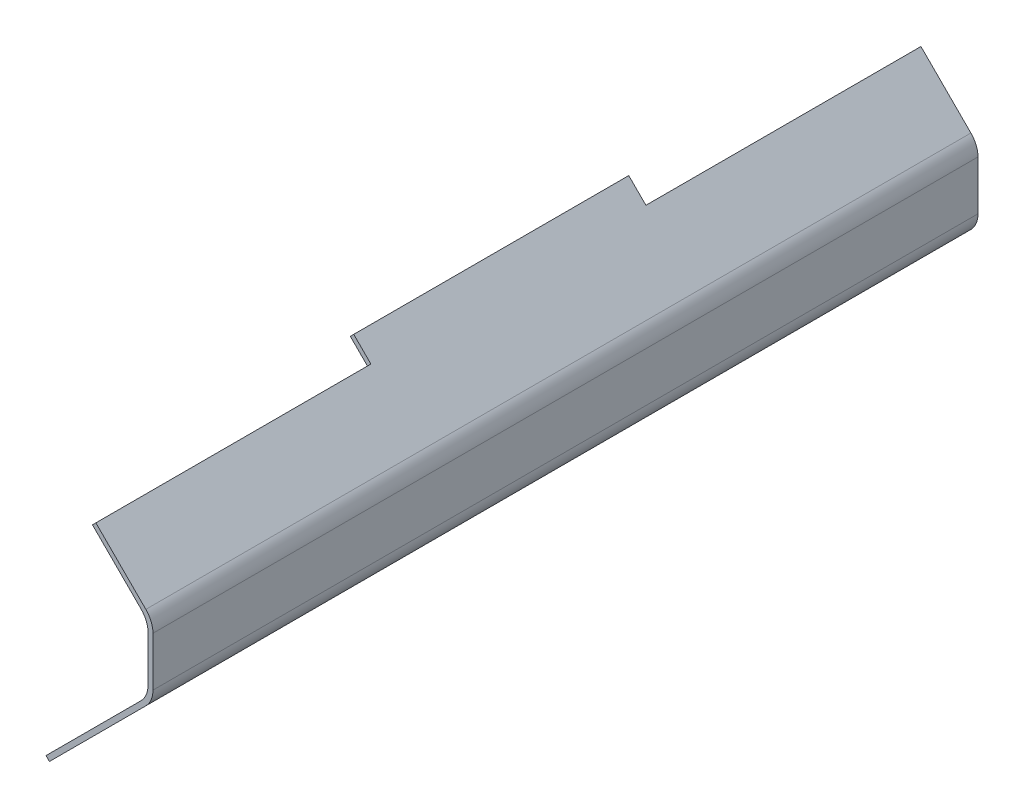
ISO-10303-21;
HEADER;
FILE_DESCRIPTION(('STEP AP214'),'2;1');
FILE_NAME('part.step','',(''),(''),'','','');
FILE_SCHEMA(('AUTOMOTIVE_DESIGN { 1 0 10303 214 1 1 1 1 }'));
ENDSEC;
DATA;
#1=APPLICATION_CONTEXT('core data for automotive mechanical design processes');
#2=APPLICATION_PROTOCOL_DEFINITION('international standard','automotive_design',2000,#1);
#3=PRODUCT_CONTEXT('',#1,'mechanical');
#4=PRODUCT('Part','Part','',(#3));
#5=PRODUCT_RELATED_PRODUCT_CATEGORY('part','',(#4));
#6=PRODUCT_DEFINITION_FORMATION('','',#4);
#7=PRODUCT_DEFINITION_CONTEXT('part definition',#1,'design');
#8=PRODUCT_DEFINITION('design','',#6,#7);
#9=PRODUCT_DEFINITION_SHAPE('','',#8);
#10=(LENGTH_UNIT() NAMED_UNIT(*) SI_UNIT(.MILLI.,.METRE.));
#11=(NAMED_UNIT(*) PLANE_ANGLE_UNIT() SI_UNIT($,.RADIAN.));
#12=(NAMED_UNIT(*) SI_UNIT($,.STERADIAN.) SOLID_ANGLE_UNIT());
#13=UNCERTAINTY_MEASURE_WITH_UNIT(LENGTH_MEASURE(1.E-05),#10,'distance_accuracy_value','');
#14=(GEOMETRIC_REPRESENTATION_CONTEXT(3) GLOBAL_UNCERTAINTY_ASSIGNED_CONTEXT((#13)) GLOBAL_UNIT_ASSIGNED_CONTEXT((#10,
#11,#12)) REPRESENTATION_CONTEXT('',''));
#15=CARTESIAN_POINT('',(0.,0.,0.));
#16=DIRECTION('',(0.,0.,1.));
#17=DIRECTION('',(1.,0.,0.));
#18=AXIS2_PLACEMENT_3D('',#15,#16,#17);
#19=CARTESIAN_POINT('',(37.8050865276332,-56.9472221513642,340.));
#20=DIRECTION('',(0.707106781186551,0.707106781186544,0.));
#21=DIRECTION('',(-0.707106781186544,0.707106781186551,0.));
#22=AXIS2_PLACEMENT_3D('',#19,#20,#21);
#23=PLANE('',#22);
#24=DIRECTION('',(0.,0.,-1.));
#25=VECTOR('',#24,1.);
#26=CARTESIAN_POINT('',(37.8050865276332,-56.9472221513642,340.));
#27=LINE('',#26,#25);
#28=CARTESIAN_POINT('',(37.8050865276332,-56.9472221513642,113.333333333333));
#29=VERTEX_POINT('',#28);
#30=CARTESIAN_POINT('',(37.8050865276332,-56.9472221513642,0.));
#31=VERTEX_POINT('',#30);
#32=EDGE_CURVE('E189',#29,#31,#27,.T.);
#33=ORIENTED_EDGE('',*,*,#32,.F.);
#34=DIRECTION('',(-0.707106781186548,0.707106781186547,0.));
#35=VECTOR('',#34,1.);
#36=CARTESIAN_POINT('',(59.1335136523794,-78.2756492761103,113.333333333333));
#37=LINE('',#36,#35);
#38=CARTESIAN_POINT('',(36.3908729652601,-55.5330085889911,113.333333333333));
#39=VERTEX_POINT('',#38);
#40=EDGE_CURVE('E173',#29,#39,#37,.T.);
#41=ORIENTED_EDGE('',*,*,#40,.T.);
#42=DIRECTION('',(0.,0.,-1.));
#43=VECTOR('',#42,1.);
#44=CARTESIAN_POINT('',(36.3908729652601,-55.5330085889911,340.));
#45=LINE('',#44,#43);
#46=CARTESIAN_POINT('',(36.3908729652601,-55.5330085889911,0.));
#47=VERTEX_POINT('',#46);
#48=EDGE_CURVE('E187',#39,#47,#45,.T.);
#49=ORIENTED_EDGE('',*,*,#48,.T.);
#50=DIRECTION('',(0.707106781186544,-0.707106781186551,0.));
#51=VECTOR('',#50,1.);
#52=CARTESIAN_POINT('',(37.8050865276332,-56.9472221513642,0.));
#53=LINE('',#52,#51);
#54=EDGE_CURVE('E296',#47,#31,#53,.T.);
#55=ORIENTED_EDGE('',*,*,#54,.T.);
#56=EDGE_LOOP('',(#33,#41,#49,#55));
#57=FACE_BOUND('',#56,.T.);
#58=ADVANCED_FACE('F32',(#57),#23,.F.);
#59=CARTESIAN_POINT('',(78.4619407771256,13.4619407771256,340.));
#60=DIRECTION('',(0.707106781186547,0.707106781186547,0.));
#61=DIRECTION('',(-0.707106781186548,0.707106781186548,0.));
#62=AXIS2_PLACEMENT_3D('',#59,#60,#61);
#63=PLANE('',#62);
#64=DIRECTION('',(0.707106781186547,-0.707106781186547,0.));
#65=VECTOR('',#64,1.);
#66=CARTESIAN_POINT('',(78.4619407771256,13.4619407771256,0.));
#67=LINE('',#66,#65);
#68=CARTESIAN_POINT('',(55.533008588991,36.3908729652601,0.));
#69=VERTEX_POINT('',#68);
#70=CARTESIAN_POINT('',(75.5330085889911,16.3908729652601,0.));
#71=VERTEX_POINT('',#70);
#72=EDGE_CURVE('E253',#69,#71,#67,.T.);
#73=ORIENTED_EDGE('',*,*,#72,.T.);
#74=DIRECTION('',(0.,0.,-1.));
#75=VECTOR('',#74,1.);
#76=CARTESIAN_POINT('',(75.5330085889911,16.3908729652601,340.));
#77=LINE('',#76,#75);
#78=CARTESIAN_POINT('',(75.5330085889911,16.3908729652601,340.));
#79=VERTEX_POINT('',#78);
#80=EDGE_CURVE('E242',#71,#79,#77,.F.);
#81=ORIENTED_EDGE('',*,*,#80,.T.);
#82=DIRECTION('',(0.707106781186547,-0.707106781186547,0.));
#83=VECTOR('',#82,1.);
#84=CARTESIAN_POINT('',(78.4619407771256,13.4619407771256,340.));
#85=LINE('',#84,#83);
#86=CARTESIAN_POINT('',(55.533008588991,36.3908729652601,340.));
#87=VERTEX_POINT('',#86);
#88=EDGE_CURVE('E274',#87,#79,#85,.T.);
#89=ORIENTED_EDGE('',*,*,#88,.F.);
#90=DIRECTION('',(0.,0.,1.));
#91=VECTOR('',#90,1.);
#92=CARTESIAN_POINT('',(55.533008588991,36.3908729652601,340.));
#93=LINE('',#92,#91);
#94=CARTESIAN_POINT('',(55.533008588991,36.3908729652601,226.666666666667));
#95=VERTEX_POINT('',#94);
#96=EDGE_CURVE('E354',#95,#87,#93,.T.);
#97=ORIENTED_EDGE('',*,*,#96,.F.);
#98=DIRECTION('',(0.707106781186547,-0.707106781186547,0.));
#99=VECTOR('',#98,1.);
#100=CARTESIAN_POINT('',(48.4619407771256,43.4619407771256,226.666666666667));
#101=LINE('',#100,#99);
#102=CARTESIAN_POINT('',(48.4619407771256,43.4619407771256,226.666666666667));
#103=VERTEX_POINT('',#102);
#104=EDGE_CURVE('E357',#103,#95,#101,.T.);
#105=ORIENTED_EDGE('',*,*,#104,.F.);
#106=DIRECTION('',(0.,0.,-1.));
#107=VECTOR('',#106,1.);
#108=CARTESIAN_POINT('',(48.4619407771256,43.4619407771256,340.));
#109=LINE('',#108,#107);
#110=CARTESIAN_POINT('',(48.4619407771256,43.4619407771256,113.333333333333));
#111=VERTEX_POINT('',#110);
#112=EDGE_CURVE('E292',#103,#111,#109,.T.);
#113=ORIENTED_EDGE('',*,*,#112,.T.);
#114=DIRECTION('',(-0.707106781186547,0.707106781186548,0.));
#115=VECTOR('',#114,1.);
#116=CARTESIAN_POINT('',(48.4619407771256,43.4619407771256,113.333333333333));
#117=LINE('',#116,#115);
#118=CARTESIAN_POINT('',(55.533008588991,36.3908729652601,113.333333333333));
#119=VERTEX_POINT('',#118);
#120=EDGE_CURVE('E341',#119,#111,#117,.T.);
#121=ORIENTED_EDGE('',*,*,#120,.F.);
#122=DIRECTION('',(0.,0.,1.));
#123=VECTOR('',#122,1.);
#124=CARTESIAN_POINT('',(55.533008588991,36.3908729652601,0.));
#125=LINE('',#124,#123);
#126=EDGE_CURVE('E266',#69,#119,#125,.T.);
#127=ORIENTED_EDGE('',*,*,#126,.F.);
#128=EDGE_LOOP('',(#73,#81,#89,#97,#105,#113,#121,#127));
#129=FACE_BOUND('',#128,.T.);
#130=ADVANCED_FACE('F261',(#129),#63,.F.);
#131=CARTESIAN_POINT('',(78.4619407771256,13.4619407771256,340.));
#132=DIRECTION('',(1.,0.,0.));
#133=DIRECTION('',(0.,0.,-1.));
#134=AXIS2_PLACEMENT_3D('',#131,#132,#133);
#135=PLANE('',#134);
#136=DIRECTION('',(0.,-1.,0.));
#137=VECTOR('',#136,1.);
#138=CARTESIAN_POINT('',(78.4619407771256,13.4619407771256,0.));
#139=LINE('',#138,#137);
#140=CARTESIAN_POINT('',(78.4619407771256,9.31980515339464,0.));
#141=VERTEX_POINT('',#140);
#142=CARTESIAN_POINT('',(78.4619407771256,-9.31980515339464,0.));
#143=VERTEX_POINT('',#142);
#144=EDGE_CURVE('E255',#141,#143,#139,.T.);
#145=ORIENTED_EDGE('',*,*,#144,.T.);
#146=DIRECTION('',(0.,0.,-1.));
#147=VECTOR('',#146,1.);
#148=CARTESIAN_POINT('',(78.4619407771256,-9.31980515339465,340.));
#149=LINE('',#148,#147);
#150=CARTESIAN_POINT('',(78.4619407771256,-9.31980515339464,340.));
#151=VERTEX_POINT('',#150);
#152=EDGE_CURVE('E240',#143,#151,#149,.F.);
#153=ORIENTED_EDGE('',*,*,#152,.T.);
#154=DIRECTION('',(0.,-1.,0.));
#155=VECTOR('',#154,1.);
#156=CARTESIAN_POINT('',(78.4619407771256,13.4619407771256,340.));
#157=LINE('',#156,#155);
#158=CARTESIAN_POINT('',(78.4619407771256,9.31980515339464,340.));
#159=VERTEX_POINT('',#158);
#160=EDGE_CURVE('E273',#159,#151,#157,.T.);
#161=ORIENTED_EDGE('',*,*,#160,.F.);
#162=DIRECTION('',(0.,0.,-1.));
#163=VECTOR('',#162,1.);
#164=CARTESIAN_POINT('',(78.4619407771256,9.31980515339464,0.));
#165=LINE('',#164,#163);
#166=EDGE_CURVE('E237',#159,#141,#165,.T.);
#167=ORIENTED_EDGE('',*,*,#166,.T.);
#168=EDGE_LOOP('',(#145,#153,#161,#167));
#169=FACE_BOUND('',#168,.T.);
#170=ADVANCED_FACE('F276',(#169),#135,.F.);
#171=CARTESIAN_POINT('',(36.3908729652601,-55.5330085889911,340.));
#172=DIRECTION('',(0.707106781186548,-0.707106781186547,0.));
#173=DIRECTION('',(0.707106781186547,0.707106781186548,0.));
#174=AXIS2_PLACEMENT_3D('',#171,#172,#173);
#175=PLANE('',#174);
#176=DIRECTION('',(-0.707106781186547,-0.707106781186548,0.));
#177=VECTOR('',#176,1.);
#178=CARTESIAN_POINT('',(36.3908729652601,-55.5330085889911,340.));
#179=LINE('',#178,#177);
#180=CARTESIAN_POINT('',(75.533008588991,-16.3908729652601,340.));
#181=VERTEX_POINT('',#180);
#182=CARTESIAN_POINT('',(36.3908729652601,-55.5330085889911,340.));
#183=VERTEX_POINT('',#182);
#184=EDGE_CURVE('E278',#181,#183,#179,.T.);
#185=ORIENTED_EDGE('',*,*,#184,.F.);
#186=DIRECTION('',(0.,0.,-1.));
#187=VECTOR('',#186,1.);
#188=CARTESIAN_POINT('',(75.5330085889911,-16.3908729652601,0.));
#189=LINE('',#188,#187);
#190=CARTESIAN_POINT('',(75.533008588991,-16.3908729652601,0.));
#191=VERTEX_POINT('',#190);
#192=EDGE_CURVE('E235',#181,#191,#189,.T.);
#193=ORIENTED_EDGE('',*,*,#192,.T.);
#194=DIRECTION('',(-0.707106781186547,-0.707106781186548,0.));
#195=VECTOR('',#194,1.);
#196=CARTESIAN_POINT('',(36.3908729652601,-55.5330085889911,0.));
#197=LINE('',#196,#195);
#198=EDGE_CURVE('E196',#191,#47,#197,.T.);
#199=ORIENTED_EDGE('',*,*,#198,.T.);
#200=ORIENTED_EDGE('',*,*,#48,.F.);
#201=DIRECTION('',(-0.707106781186547,-0.707106781186547,0.));
#202=VECTOR('',#201,1.);
#203=CARTESIAN_POINT('',(36.3908729652601,-55.5330085889911,113.333333333333));
#204=LINE('',#203,#202);
#205=CARTESIAN_POINT('',(43.4619407771256,-48.4619407771256,113.333333333333));
#206=VERTEX_POINT('',#205);
#207=EDGE_CURVE('E170',#206,#39,#204,.T.);
#208=ORIENTED_EDGE('',*,*,#207,.F.);
#209=DIRECTION('',(0.,0.,-1.));
#210=VECTOR('',#209,1.);
#211=CARTESIAN_POINT('',(43.4619407771256,-48.4619407771256,113.333333333333));
#212=LINE('',#211,#210);
#213=CARTESIAN_POINT('',(43.4619407771256,-48.4619407771256,226.666666666667));
#214=VERTEX_POINT('',#213);
#215=EDGE_CURVE('E191',#214,#206,#212,.T.);
#216=ORIENTED_EDGE('',*,*,#215,.F.);
#217=DIRECTION('',(0.707106781186547,0.707106781186547,0.));
#218=VECTOR('',#217,1.);
#219=CARTESIAN_POINT('',(36.3908729652601,-55.5330085889911,226.666666666667));
#220=LINE('',#219,#218);
#221=CARTESIAN_POINT('',(36.3908729652601,-55.5330085889911,226.666666666667));
#222=VERTEX_POINT('',#221);
#223=EDGE_CURVE('E181',#222,#214,#220,.T.);
#224=ORIENTED_EDGE('',*,*,#223,.F.);
#225=EDGE_CURVE('E197',#183,#222,#45,.T.);
#226=ORIENTED_EDGE('',*,*,#225,.F.);
#227=EDGE_LOOP('',(#185,#193,#199,#200,#208,#216,#224,#226));
#228=FACE_BOUND('',#227,.T.);
#229=ADVANCED_FACE('F193',(#228),#175,.F.);
#230=ORIENTED_EDGE('',*,*,#225,.T.);
#231=DIRECTION('',(-0.707106781186548,0.707106781186547,0.));
#232=VECTOR('',#231,1.);
#233=CARTESIAN_POINT('',(59.1335136523794,-78.2756492761103,226.666666666667));
#234=LINE('',#233,#232);
#235=CARTESIAN_POINT('',(37.8050865276332,-56.9472221513642,226.666666666667));
#236=VERTEX_POINT('',#235);
#237=EDGE_CURVE('E190',#236,#222,#234,.T.);
#238=ORIENTED_EDGE('',*,*,#237,.F.);
#239=CARTESIAN_POINT('',(37.8050865276332,-56.9472221513642,340.));
#240=VERTEX_POINT('',#239);
#241=EDGE_CURVE('E198',#240,#236,#27,.T.);
#242=ORIENTED_EDGE('',*,*,#241,.F.);
#243=DIRECTION('',(0.707106781186544,-0.707106781186551,0.));
#244=VECTOR('',#243,1.);
#245=CARTESIAN_POINT('',(37.8050865276332,-56.9472221513642,340.));
#246=LINE('',#245,#244);
#247=EDGE_CURVE('E280',#183,#240,#246,.T.);
#248=ORIENTED_EDGE('',*,*,#247,.F.);
#249=EDGE_LOOP('',(#230,#238,#242,#248));
#250=FACE_BOUND('',#249,.T.);
#251=ADVANCED_FACE('F376',(#250),#23,.F.);
#252=CARTESIAN_POINT('',(80.4619407771256,-14.2903679018718,340.));
#253=DIRECTION('',(-0.707106781186548,0.707106781186547,0.));
#254=DIRECTION('',(-0.707106781186547,-0.707106781186548,0.));
#255=AXIS2_PLACEMENT_3D('',#252,#253,#254);
#256=PLANE('',#255);
#257=DIRECTION('',(0.707106781186547,0.707106781186548,0.));
#258=VECTOR('',#257,1.);
#259=CARTESIAN_POINT('',(80.4619407771256,-14.2903679018718,0.));
#260=LINE('',#259,#258);
#261=CARTESIAN_POINT('',(77.5330085889911,-17.2193000900063,0.));
#262=VERTEX_POINT('',#261);
#263=EDGE_CURVE('E298',#31,#262,#260,.T.);
#264=ORIENTED_EDGE('',*,*,#263,.T.);
#265=DIRECTION('',(0.,0.,-1.));
#266=VECTOR('',#265,1.);
#267=CARTESIAN_POINT('',(77.5330085889911,-17.2193000900063,340.));
#268=LINE('',#267,#266);
#269=CARTESIAN_POINT('',(77.5330085889911,-17.2193000900063,340.));
#270=VERTEX_POINT('',#269);
#271=EDGE_CURVE('E47',#262,#270,#268,.F.);
#272=ORIENTED_EDGE('',*,*,#271,.T.);
#273=DIRECTION('',(0.707106781186547,0.707106781186548,0.));
#274=VECTOR('',#273,1.);
#275=CARTESIAN_POINT('',(80.4619407771256,-14.2903679018718,340.));
#276=LINE('',#275,#274);
#277=EDGE_CURVE('E287',#240,#270,#276,.T.);
#278=ORIENTED_EDGE('',*,*,#277,.F.);
#279=ORIENTED_EDGE('',*,*,#241,.T.);
#280=DIRECTION('',(0.707106781186547,0.707106781186548,0.));
#281=VECTOR('',#280,1.);
#282=CARTESIAN_POINT('',(80.4619407771256,-14.2903679018718,226.666666666667));
#283=LINE('',#282,#281);
#284=CARTESIAN_POINT('',(44.8761543394987,-49.8761543394987,226.666666666667));
#285=VERTEX_POINT('',#284);
#286=EDGE_CURVE('E210',#236,#285,#283,.T.);
#287=ORIENTED_EDGE('',*,*,#286,.T.);
#288=DIRECTION('',(0.,0.,-1.));
#289=VECTOR('',#288,1.);
#290=CARTESIAN_POINT('',(44.8761543394987,-49.8761543394987,340.));
#291=LINE('',#290,#289);
#292=CARTESIAN_POINT('',(44.8761543394987,-49.8761543394987,113.333333333333));
#293=VERTEX_POINT('',#292);
#294=EDGE_CURVE('E213',#285,#293,#291,.T.);
#295=ORIENTED_EDGE('',*,*,#294,.T.);
#296=DIRECTION('',(-0.707106781186547,-0.707106781186548,0.));
#297=VECTOR('',#296,1.);
#298=CARTESIAN_POINT('',(80.4619407771256,-14.2903679018718,113.333333333333));
#299=LINE('',#298,#297);
#300=EDGE_CURVE('E216',#293,#29,#299,.T.);
#301=ORIENTED_EDGE('',*,*,#300,.T.);
#302=ORIENTED_EDGE('',*,*,#32,.T.);
#303=EDGE_LOOP('',(#264,#272,#278,#279,#287,#295,#301,#302));
#304=FACE_BOUND('',#303,.T.);
#305=ADVANCED_FACE('F310',(#304),#256,.F.);
#306=CARTESIAN_POINT('',(80.4619407771256,14.2903679018718,340.));
#307=DIRECTION('',(-1.,0.,0.));
#308=DIRECTION('',(0.,0.,1.));
#309=AXIS2_PLACEMENT_3D('',#306,#307,#308);
#310=PLANE('',#309);
#311=DIRECTION('',(0.,1.,0.));
#312=VECTOR('',#311,1.);
#313=CARTESIAN_POINT('',(80.4619407771256,14.2903679018718,0.));
#314=LINE('',#313,#312);
#315=CARTESIAN_POINT('',(80.4619407771256,-10.1482322781408,0.));
#316=VERTEX_POINT('',#315);
#317=CARTESIAN_POINT('',(80.4619407771256,10.1482322781409,0.));
#318=VERTEX_POINT('',#317);
#319=EDGE_CURVE('E300',#316,#318,#314,.T.);
#320=ORIENTED_EDGE('',*,*,#319,.T.);
#321=DIRECTION('',(0.,0.,-1.));
#322=VECTOR('',#321,1.);
#323=CARTESIAN_POINT('',(80.4619407771256,10.1482322781409,340.));
#324=LINE('',#323,#322);
#325=CARTESIAN_POINT('',(80.4619407771256,10.1482322781409,340.));
#326=VERTEX_POINT('',#325);
#327=EDGE_CURVE('E228',#318,#326,#324,.F.);
#328=ORIENTED_EDGE('',*,*,#327,.T.);
#329=DIRECTION('',(0.,1.,0.));
#330=VECTOR('',#329,1.);
#331=CARTESIAN_POINT('',(80.4619407771256,14.2903679018718,340.));
#332=LINE('',#331,#330);
#333=CARTESIAN_POINT('',(80.4619407771256,-10.1482322781408,340.));
#334=VERTEX_POINT('',#333);
#335=EDGE_CURVE('E289',#334,#326,#332,.T.);
#336=ORIENTED_EDGE('',*,*,#335,.F.);
#337=DIRECTION('',(0.,0.,-1.));
#338=VECTOR('',#337,1.);
#339=CARTESIAN_POINT('',(80.4619407771256,-10.1482322781408,340.));
#340=LINE('',#339,#338);
#341=EDGE_CURVE('E225',#334,#316,#340,.T.);
#342=ORIENTED_EDGE('',*,*,#341,.T.);
#343=EDGE_LOOP('',(#320,#328,#336,#342));
#344=FACE_BOUND('',#343,.T.);
#345=ADVANCED_FACE('F319',(#344),#310,.F.);
#346=CARTESIAN_POINT('',(49.8761543394987,44.8761543394987,340.));
#347=DIRECTION('',(-0.707106781186547,-0.707106781186548,0.));
#348=DIRECTION('',(0.707106781186548,-0.707106781186547,0.));
#349=AXIS2_PLACEMENT_3D('',#346,#347,#348);
#350=PLANE('',#349);
#351=DIRECTION('',(-0.707106781186548,0.707106781186547,0.));
#352=VECTOR('',#351,1.);
#353=CARTESIAN_POINT('',(49.8761543394987,44.8761543394987,340.));
#354=LINE('',#353,#352);
#355=CARTESIAN_POINT('',(77.533008588991,17.2193000900063,340.));
#356=VERTEX_POINT('',#355);
#357=CARTESIAN_POINT('',(56.9472221513641,37.8050865276332,340.));
#358=VERTEX_POINT('',#357);
#359=EDGE_CURVE('E291',#356,#358,#354,.T.);
#360=ORIENTED_EDGE('',*,*,#359,.F.);
#361=DIRECTION('',(0.,0.,-1.));
#362=VECTOR('',#361,1.);
#363=CARTESIAN_POINT('',(77.533008588991,17.2193000900063,340.));
#364=LINE('',#363,#362);
#365=CARTESIAN_POINT('',(77.533008588991,17.2193000900063,0.));
#366=VERTEX_POINT('',#365);
#367=EDGE_CURVE('E218',#356,#366,#364,.T.);
#368=ORIENTED_EDGE('',*,*,#367,.T.);
#369=DIRECTION('',(-0.707106781186548,0.707106781186547,0.));
#370=VECTOR('',#369,1.);
#371=CARTESIAN_POINT('',(49.8761543394987,44.8761543394987,0.));
#372=LINE('',#371,#370);
#373=CARTESIAN_POINT('',(56.9472221513641,37.8050865276332,0.));
#374=VERTEX_POINT('',#373);
#375=EDGE_CURVE('E282',#366,#374,#372,.T.);
#376=ORIENTED_EDGE('',*,*,#375,.T.);
#377=DIRECTION('',(0.,0.,1.));
#378=VECTOR('',#377,1.);
#379=CARTESIAN_POINT('',(56.9472221513641,37.8050865276332,340.));
#380=LINE('',#379,#378);
#381=CARTESIAN_POINT('',(56.9472221513641,37.8050865276332,113.333333333333));
#382=VERTEX_POINT('',#381);
#383=EDGE_CURVE('E334',#374,#382,#380,.T.);
#384=ORIENTED_EDGE('',*,*,#383,.T.);
#385=DIRECTION('',(-0.707106781186548,0.707106781186547,0.));
#386=VECTOR('',#385,1.);
#387=CARTESIAN_POINT('',(49.8761543394987,44.8761543394987,113.333333333333));
#388=LINE('',#387,#386);
#389=CARTESIAN_POINT('',(49.8761543394987,44.8761543394987,113.333333333333));
#390=VERTEX_POINT('',#389);
#391=EDGE_CURVE('E267',#382,#390,#388,.T.);
#392=ORIENTED_EDGE('',*,*,#391,.T.);
#393=DIRECTION('',(0.,0.,-1.));
#394=VECTOR('',#393,1.);
#395=CARTESIAN_POINT('',(49.8761543394987,44.8761543394987,340.));
#396=LINE('',#395,#394);
#397=CARTESIAN_POINT('',(49.8761543394987,44.8761543394987,226.666666666667));
#398=VERTEX_POINT('',#397);
#399=EDGE_CURVE('E304',#398,#390,#396,.T.);
#400=ORIENTED_EDGE('',*,*,#399,.F.);
#401=DIRECTION('',(0.707106781186548,-0.707106781186547,0.));
#402=VECTOR('',#401,1.);
#403=CARTESIAN_POINT('',(49.8761543394987,44.8761543394987,226.666666666667));
#404=LINE('',#403,#402);
#405=CARTESIAN_POINT('',(56.9472221513641,37.8050865276332,226.666666666667));
#406=VERTEX_POINT('',#405);
#407=EDGE_CURVE('E346',#398,#406,#404,.T.);
#408=ORIENTED_EDGE('',*,*,#407,.T.);
#409=DIRECTION('',(0.,0.,1.));
#410=VECTOR('',#409,1.);
#411=CARTESIAN_POINT('',(56.9472221513641,37.8050865276332,340.));
#412=LINE('',#411,#410);
#413=EDGE_CURVE('E349',#406,#358,#412,.T.);
#414=ORIENTED_EDGE('',*,*,#413,.T.);
#415=EDGE_LOOP('',(#360,#368,#376,#384,#392,#400,#408,#414));
#416=FACE_BOUND('',#415,.T.);
#417=ADVANCED_FACE('F327',(#416),#350,.F.);
#418=CARTESIAN_POINT('',(48.4619407771256,43.4619407771256,340.));
#419=DIRECTION('',(0.707106781186547,-0.707106781186547,0.));
#420=DIRECTION('',(0.707106781186548,0.707106781186548,0.));
#421=AXIS2_PLACEMENT_3D('',#418,#419,#420);
#422=PLANE('',#421);
#423=ORIENTED_EDGE('',*,*,#112,.F.);
#424=DIRECTION('',(-0.707106781186548,-0.707106781186547,0.));
#425=VECTOR('',#424,1.);
#426=CARTESIAN_POINT('',(65.1690475583121,60.1690475583122,226.666666666667));
#427=LINE('',#426,#425);
#428=EDGE_CURVE('E352',#398,#103,#427,.T.);
#429=ORIENTED_EDGE('',*,*,#428,.F.);
#430=ORIENTED_EDGE('',*,*,#399,.T.);
#431=DIRECTION('',(-0.707106781186548,-0.707106781186547,0.));
#432=VECTOR('',#431,1.);
#433=CARTESIAN_POINT('',(65.1690475583121,60.1690475583122,113.333333333333));
#434=LINE('',#433,#432);
#435=EDGE_CURVE('E337',#390,#111,#434,.T.);
#436=ORIENTED_EDGE('',*,*,#435,.T.);
#437=EDGE_LOOP('',(#423,#429,#430,#436));
#438=FACE_BOUND('',#437,.T.);
#439=ADVANCED_FACE('F433',(#438),#422,.F.);
#440=CARTESIAN_POINT('',(0.,0.,340.));
#441=DIRECTION('',(0.,0.,-1.));
#442=DIRECTION('',(-1.,0.,0.));
#443=AXIS2_PLACEMENT_3D('',#440,#441,#442);
#444=PLANE('',#443);
#445=ORIENTED_EDGE('',*,*,#335,.T.);
#446=CARTESIAN_POINT('',(70.4619407771256,10.1482322781409,340.));
#447=DIRECTION('',(0.,0.,-1.));
#448=DIRECTION('',(-1.,0.,0.));
#449=AXIS2_PLACEMENT_3D('',#446,#447,#448);
#450=CIRCLE('',#449,10.);
#451=EDGE_CURVE('E232',#326,#356,#450,.F.);
#452=ORIENTED_EDGE('',*,*,#451,.T.);
#453=ORIENTED_EDGE('',*,*,#359,.T.);
#454=DIRECTION('',(-0.707106781186548,-0.707106781186547,0.));
#455=VECTOR('',#454,1.);
#456=CARTESIAN_POINT('',(9.57106781186544,-9.57106781186545,340.));
#457=LINE('',#456,#455);
#458=EDGE_CURVE('E207',#358,#87,#457,.T.);
#459=ORIENTED_EDGE('',*,*,#458,.T.);
#460=ORIENTED_EDGE('',*,*,#88,.T.);
#461=CARTESIAN_POINT('',(68.4619407771256,9.31980515339464,340.));
#462=DIRECTION('',(0.,0.,-1.));
#463=DIRECTION('',(-1.,0.,0.));
#464=AXIS2_PLACEMENT_3D('',#461,#462,#463);
#465=CIRCLE('',#464,10.);
#466=EDGE_CURVE('E11',#79,#159,#465,.T.);
#467=ORIENTED_EDGE('',*,*,#466,.T.);
#468=ORIENTED_EDGE('',*,*,#160,.T.);
#469=CARTESIAN_POINT('',(68.4619407771256,-9.31980515339465,340.));
#470=DIRECTION('',(0.,0.,-1.));
#471=DIRECTION('',(-1.,0.,0.));
#472=AXIS2_PLACEMENT_3D('',#469,#470,#471);
#473=CIRCLE('',#472,10.);
#474=EDGE_CURVE('E55',#151,#181,#473,.T.);
#475=ORIENTED_EDGE('',*,*,#474,.T.);
#476=ORIENTED_EDGE('',*,*,#184,.T.);
#477=ORIENTED_EDGE('',*,*,#247,.T.);
#478=ORIENTED_EDGE('',*,*,#277,.T.);
#479=CARTESIAN_POINT('',(70.4619407771256,-10.1482322781408,340.));
#480=DIRECTION('',(0.,0.,-1.));
#481=DIRECTION('',(-1.,0.,0.));
#482=AXIS2_PLACEMENT_3D('',#479,#480,#481);
#483=CIRCLE('',#482,10.);
#484=EDGE_CURVE('E230',#270,#334,#483,.F.);
#485=ORIENTED_EDGE('',*,*,#484,.T.);
#486=EDGE_LOOP('',(#445,#452,#453,#459,#460,#467,#468,#475,#476,#477,#478,#485));
#487=FACE_BOUND('',#486,.T.);
#488=ADVANCED_FACE('F272',(#487),#444,.F.);
#489=CARTESIAN_POINT('',(0.,0.,0.));
#490=DIRECTION('',(0.,0.,-1.));
#491=DIRECTION('',(-1.,0.,0.));
#492=AXIS2_PLACEMENT_3D('',#489,#490,#491);
#493=PLANE('',#492);
#494=ORIENTED_EDGE('',*,*,#375,.F.);
#495=CARTESIAN_POINT('',(70.4619407771256,10.1482322781409,0.));
#496=DIRECTION('',(0.,0.,-1.));
#497=DIRECTION('',(-1.,0.,0.));
#498=AXIS2_PLACEMENT_3D('',#495,#496,#497);
#499=CIRCLE('',#498,10.);
#500=EDGE_CURVE('E223',#366,#318,#499,.T.);
#501=ORIENTED_EDGE('',*,*,#500,.T.);
#502=ORIENTED_EDGE('',*,*,#319,.F.);
#503=CARTESIAN_POINT('',(70.4619407771256,-10.1482322781408,0.));
#504=DIRECTION('',(0.,0.,-1.));
#505=DIRECTION('',(-1.,0.,0.));
#506=AXIS2_PLACEMENT_3D('',#503,#504,#505);
#507=CIRCLE('',#506,10.);
#508=EDGE_CURVE('E221',#316,#262,#507,.T.);
#509=ORIENTED_EDGE('',*,*,#508,.T.);
#510=ORIENTED_EDGE('',*,*,#263,.F.);
#511=ORIENTED_EDGE('',*,*,#54,.F.);
#512=ORIENTED_EDGE('',*,*,#198,.F.);
#513=CARTESIAN_POINT('',(68.4619407771256,-9.31980515339465,0.));
#514=DIRECTION('',(0.,0.,-1.));
#515=DIRECTION('',(-1.,0.,0.));
#516=AXIS2_PLACEMENT_3D('',#513,#514,#515);
#517=CIRCLE('',#516,10.);
#518=EDGE_CURVE('E244',#191,#143,#517,.F.);
#519=ORIENTED_EDGE('',*,*,#518,.T.);
#520=ORIENTED_EDGE('',*,*,#144,.F.);
#521=CARTESIAN_POINT('',(68.4619407771256,9.31980515339464,0.));
#522=DIRECTION('',(0.,0.,-1.));
#523=DIRECTION('',(-1.,0.,0.));
#524=AXIS2_PLACEMENT_3D('',#521,#522,#523);
#525=CIRCLE('',#524,10.);
#526=EDGE_CURVE('E40',#141,#71,#525,.F.);
#527=ORIENTED_EDGE('',*,*,#526,.T.);
#528=ORIENTED_EDGE('',*,*,#72,.F.);
#529=DIRECTION('',(-0.707106781186548,-0.707106781186547,0.));
#530=VECTOR('',#529,1.);
#531=CARTESIAN_POINT('',(9.57106781186545,-9.57106781186545,0.));
#532=LINE('',#531,#530);
#533=EDGE_CURVE('E201',#374,#69,#532,.T.);
#534=ORIENTED_EDGE('',*,*,#533,.F.);
#535=EDGE_LOOP('',(#494,#501,#502,#509,#510,#511,#512,#519,#520,#527,#528,#534));
#536=FACE_BOUND('',#535,.T.);
#537=ADVANCED_FACE('F251',(#536),#493,.T.);
#538=CARTESIAN_POINT('',(65.1690475583121,60.1690475583122,113.333333333333));
#539=DIRECTION('',(0.,0.,1.));
#540=DIRECTION('',(1.,0.,0.));
#541=AXIS2_PLACEMENT_3D('',#538,#539,#540);
#542=PLANE('',#541);
#543=DIRECTION('',(-0.707106781186548,-0.707106781186547,0.));
#544=VECTOR('',#543,1.);
#545=CARTESIAN_POINT('',(72.2401153701776,53.0979797464467,113.333333333333));
#546=LINE('',#545,#544);
#547=EDGE_CURVE('E335',#382,#119,#546,.T.);
#548=ORIENTED_EDGE('',*,*,#547,.T.);
#549=ORIENTED_EDGE('',*,*,#120,.T.);
#550=ORIENTED_EDGE('',*,*,#435,.F.);
#551=ORIENTED_EDGE('',*,*,#391,.F.);
#552=EDGE_LOOP('',(#548,#549,#550,#551));
#553=FACE_BOUND('',#552,.T.);
#554=ADVANCED_FACE('F425',(#553),#542,.F.);
#555=CARTESIAN_POINT('',(72.2401153701776,53.0979797464467,0.));
#556=DIRECTION('',(0.707106781186547,-0.707106781186548,0.));
#557=DIRECTION('',(0.707106781186548,0.707106781186547,0.));
#558=AXIS2_PLACEMENT_3D('',#555,#556,#557);
#559=PLANE('',#558);
#560=ORIENTED_EDGE('',*,*,#533,.T.);
#561=ORIENTED_EDGE('',*,*,#126,.T.);
#562=ORIENTED_EDGE('',*,*,#547,.F.);
#563=ORIENTED_EDGE('',*,*,#383,.F.);
#564=EDGE_LOOP('',(#560,#561,#562,#563));
#565=FACE_BOUND('',#564,.T.);
#566=ADVANCED_FACE('F332',(#565),#559,.F.);
#567=CARTESIAN_POINT('',(65.1690475583121,60.1690475583122,226.666666666667));
#568=DIRECTION('',(0.,0.,-1.));
#569=DIRECTION('',(-1.,0.,0.));
#570=AXIS2_PLACEMENT_3D('',#567,#568,#569);
#571=PLANE('',#570);
#572=ORIENTED_EDGE('',*,*,#428,.T.);
#573=ORIENTED_EDGE('',*,*,#104,.T.);
#574=DIRECTION('',(-0.707106781186548,-0.707106781186547,0.));
#575=VECTOR('',#574,1.);
#576=CARTESIAN_POINT('',(72.2401153701776,53.0979797464467,226.666666666667));
#577=LINE('',#576,#575);
#578=EDGE_CURVE('E351',#406,#95,#577,.T.);
#579=ORIENTED_EDGE('',*,*,#578,.F.);
#580=ORIENTED_EDGE('',*,*,#407,.F.);
#581=EDGE_LOOP('',(#572,#573,#579,#580));
#582=FACE_BOUND('',#581,.T.);
#583=ADVANCED_FACE('F420',(#582),#571,.F.);
#584=CARTESIAN_POINT('',(72.2401153701776,53.0979797464467,340.));
#585=DIRECTION('',(0.707106781186547,-0.707106781186548,0.));
#586=DIRECTION('',(0.707106781186548,0.707106781186547,0.));
#587=AXIS2_PLACEMENT_3D('',#584,#585,#586);
#588=PLANE('',#587);
#589=ORIENTED_EDGE('',*,*,#578,.T.);
#590=ORIENTED_EDGE('',*,*,#96,.T.);
#591=ORIENTED_EDGE('',*,*,#458,.F.);
#592=ORIENTED_EDGE('',*,*,#413,.F.);
#593=EDGE_LOOP('',(#589,#590,#591,#592));
#594=FACE_BOUND('',#593,.T.);
#595=ADVANCED_FACE('F417',(#594),#588,.F.);
#596=CARTESIAN_POINT('',(59.1335136523794,-78.2756492761103,113.333333333333));
#597=DIRECTION('',(0.,0.,-1.));
#598=DIRECTION('',(-1.,0.,0.));
#599=AXIS2_PLACEMENT_3D('',#596,#597,#598);
#600=PLANE('',#599);
#601=DIRECTION('',(-0.707106781186548,0.707106781186547,0.));
#602=VECTOR('',#601,1.);
#603=CARTESIAN_POINT('',(66.2045814642449,-71.2045814642449,113.333333333333));
#604=LINE('',#603,#602);
#605=EDGE_CURVE('E176',#293,#206,#604,.T.);
#606=ORIENTED_EDGE('',*,*,#605,.T.);
#607=ORIENTED_EDGE('',*,*,#207,.T.);
#608=ORIENTED_EDGE('',*,*,#40,.F.);
#609=ORIENTED_EDGE('',*,*,#300,.F.);
#610=EDGE_LOOP('',(#606,#607,#608,#609));
#611=FACE_BOUND('',#610,.T.);
#612=ADVANCED_FACE('F172',(#611),#600,.F.);
#613=CARTESIAN_POINT('',(66.2045814642449,-71.2045814642449,113.333333333333));
#614=DIRECTION('',(0.707106781186547,0.707106781186548,0.));
#615=DIRECTION('',(-0.707106781186548,0.707106781186547,0.));
#616=AXIS2_PLACEMENT_3D('',#613,#614,#615);
#617=PLANE('',#616);
#618=DIRECTION('',(-0.707106781186548,0.707106781186547,0.));
#619=VECTOR('',#618,1.);
#620=CARTESIAN_POINT('',(66.2045814642449,-71.2045814642449,226.666666666667));
#621=LINE('',#620,#619);
#622=EDGE_CURVE('E361',#285,#214,#621,.T.);
#623=ORIENTED_EDGE('',*,*,#622,.T.);
#624=ORIENTED_EDGE('',*,*,#215,.T.);
#625=ORIENTED_EDGE('',*,*,#605,.F.);
#626=ORIENTED_EDGE('',*,*,#294,.F.);
#627=EDGE_LOOP('',(#623,#624,#625,#626));
#628=FACE_BOUND('',#627,.T.);
#629=ADVANCED_FACE('F373',(#628),#617,.F.);
#630=CARTESIAN_POINT('',(59.1335136523794,-78.2756492761103,226.666666666667));
#631=DIRECTION('',(0.,0.,1.));
#632=DIRECTION('',(1.,0.,0.));
#633=AXIS2_PLACEMENT_3D('',#630,#631,#632);
#634=PLANE('',#633);
#635=ORIENTED_EDGE('',*,*,#237,.T.);
#636=ORIENTED_EDGE('',*,*,#223,.T.);
#637=ORIENTED_EDGE('',*,*,#622,.F.);
#638=ORIENTED_EDGE('',*,*,#286,.F.);
#639=EDGE_LOOP('',(#635,#636,#637,#638));
#640=FACE_BOUND('',#639,.T.);
#641=ADVANCED_FACE('F368',(#640),#634,.F.);
#642=CARTESIAN_POINT('',(70.4619407771256,10.1482322781409,340.));
#643=DIRECTION('',(0.,0.,-1.));
#644=DIRECTION('',(-1.,0.,0.));
#645=AXIS2_PLACEMENT_3D('',#642,#643,#644);
#646=CYLINDRICAL_SURFACE('',#645,10.);
#647=ORIENTED_EDGE('',*,*,#451,.F.);
#648=ORIENTED_EDGE('',*,*,#327,.F.);
#649=ORIENTED_EDGE('',*,*,#500,.F.);
#650=ORIENTED_EDGE('',*,*,#367,.F.);
#651=EDGE_LOOP('',(#647,#648,#649,#650));
#652=FACE_BOUND('',#651,.T.);
#653=ADVANCED_FACE('F325',(#652),#646,.T.);
#654=CARTESIAN_POINT('',(70.4619407771256,-10.1482322781408,340.));
#655=DIRECTION('',(0.,0.,-1.));
#656=DIRECTION('',(-1.,0.,0.));
#657=AXIS2_PLACEMENT_3D('',#654,#655,#656);
#658=CYLINDRICAL_SURFACE('',#657,10.);
#659=ORIENTED_EDGE('',*,*,#484,.F.);
#660=ORIENTED_EDGE('',*,*,#271,.F.);
#661=ORIENTED_EDGE('',*,*,#508,.F.);
#662=ORIENTED_EDGE('',*,*,#341,.F.);
#663=EDGE_LOOP('',(#659,#660,#661,#662));
#664=FACE_BOUND('',#663,.T.);
#665=ADVANCED_FACE('F316',(#664),#658,.T.);
#666=CARTESIAN_POINT('',(68.4619407771256,-9.31980515339465,340.));
#667=DIRECTION('',(0.,0.,1.));
#668=DIRECTION('',(1.,0.,0.));
#669=AXIS2_PLACEMENT_3D('',#666,#667,#668);
#670=CYLINDRICAL_SURFACE('',#669,10.);
#671=ORIENTED_EDGE('',*,*,#474,.F.);
#672=ORIENTED_EDGE('',*,*,#152,.F.);
#673=ORIENTED_EDGE('',*,*,#518,.F.);
#674=ORIENTED_EDGE('',*,*,#192,.F.);
#675=EDGE_LOOP('',(#671,#672,#673,#674));
#676=FACE_BOUND('',#675,.T.);
#677=ADVANCED_FACE('F380',(#676),#670,.F.);
#678=CARTESIAN_POINT('',(68.4619407771256,9.31980515339464,340.));
#679=DIRECTION('',(0.,0.,1.));
#680=DIRECTION('',(1.,0.,0.));
#681=AXIS2_PLACEMENT_3D('',#678,#679,#680);
#682=CYLINDRICAL_SURFACE('',#681,10.);
#683=ORIENTED_EDGE('',*,*,#466,.F.);
#684=ORIENTED_EDGE('',*,*,#80,.F.);
#685=ORIENTED_EDGE('',*,*,#526,.F.);
#686=ORIENTED_EDGE('',*,*,#166,.F.);
#687=EDGE_LOOP('',(#683,#684,#685,#686));
#688=FACE_BOUND('',#687,.T.);
#689=ADVANCED_FACE('F34',(#688),#682,.F.);
#690=CLOSED_SHELL('',(#58,#130,#170,#229,#251,#305,#345,#417,#439,#488,#537,#554,#566,#583,#595,
#612,#629,#641,#653,#665,#677,#689));
#691=MANIFOLD_SOLID_BREP('B2',#690);
#692=ADVANCED_BREP_SHAPE_REPRESENTATION('',(#18,#691),#14);
#693=SHAPE_DEFINITION_REPRESENTATION(#9,#692);
ENDSEC;
END-ISO-10303-21;
